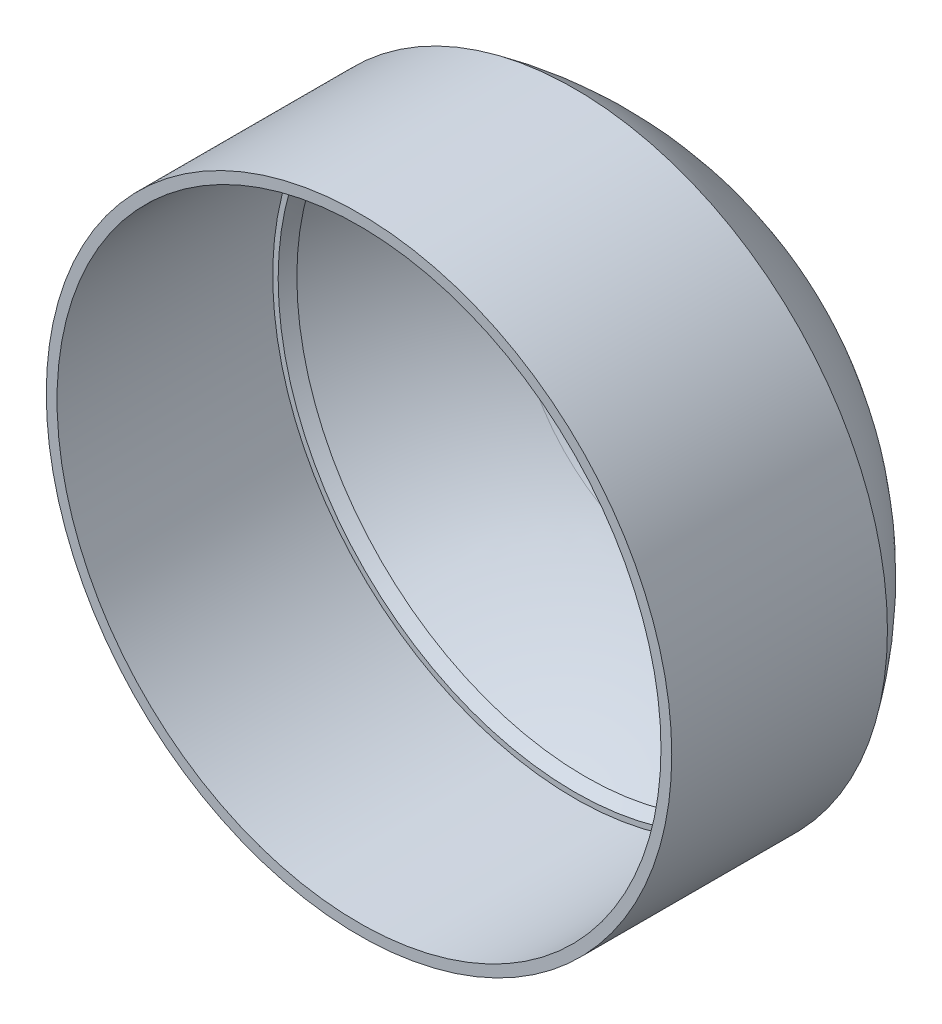
ISO-10303-21;
HEADER;
FILE_DESCRIPTION(('STEP AP214'),'2;1');
FILE_NAME('part.step','',(''),(''),'','','');
FILE_SCHEMA(('AUTOMOTIVE_DESIGN { 1 0 10303 214 1 1 1 1 }'));
ENDSEC;
DATA;
#1=APPLICATION_CONTEXT('core data for automotive mechanical design processes');
#2=APPLICATION_PROTOCOL_DEFINITION('international standard','automotive_design',2000,#1);
#3=PRODUCT_CONTEXT('',#1,'mechanical');
#4=PRODUCT('Part','Part','',(#3));
#5=PRODUCT_RELATED_PRODUCT_CATEGORY('part','',(#4));
#6=PRODUCT_DEFINITION_FORMATION('','',#4);
#7=PRODUCT_DEFINITION_CONTEXT('part definition',#1,'design');
#8=PRODUCT_DEFINITION('design','',#6,#7);
#9=PRODUCT_DEFINITION_SHAPE('','',#8);
#10=(LENGTH_UNIT() NAMED_UNIT(*) SI_UNIT(.MILLI.,.METRE.));
#11=(NAMED_UNIT(*) PLANE_ANGLE_UNIT() SI_UNIT($,.RADIAN.));
#12=(NAMED_UNIT(*) SI_UNIT($,.STERADIAN.) SOLID_ANGLE_UNIT());
#13=UNCERTAINTY_MEASURE_WITH_UNIT(LENGTH_MEASURE(1.E-05),#10,'distance_accuracy_value','');
#14=(GEOMETRIC_REPRESENTATION_CONTEXT(3) GLOBAL_UNCERTAINTY_ASSIGNED_CONTEXT((#13)) GLOBAL_UNIT_ASSIGNED_CONTEXT((#10,
#11,#12)) REPRESENTATION_CONTEXT('',''));
#15=CARTESIAN_POINT('',(0.,0.,0.));
#16=DIRECTION('',(0.,0.,1.));
#17=DIRECTION('',(1.,0.,0.));
#18=AXIS2_PLACEMENT_3D('',#15,#16,#17);
#19=CARTESIAN_POINT('',(0.,0.,10.));
#20=DIRECTION('',(0.,0.,1.));
#21=DIRECTION('',(1.,0.,0.));
#22=AXIS2_PLACEMENT_3D('',#19,#20,#21);
#23=PLANE('',#22);
#24=CARTESIAN_POINT('',(0.,0.,10.));
#25=DIRECTION('',(0.,0.,1.));
#26=DIRECTION('',(1.,0.,0.));
#27=AXIS2_PLACEMENT_3D('',#24,#25,#26);
#28=CIRCLE('',#27,29.);
#29=CARTESIAN_POINT('',(29.,0.,10.));
#30=VERTEX_POINT('',#29);
#31=EDGE_CURVE('E11',#30,#30,#28,.T.);
#32=ORIENTED_EDGE('',*,*,#31,.T.);
#33=EDGE_LOOP('',(#32));
#34=FACE_BOUND('',#33,.T.);
#35=CARTESIAN_POINT('',(0.,0.,10.));
#36=DIRECTION('',(0.,0.,1.));
#37=DIRECTION('',(1.,0.,0.));
#38=AXIS2_PLACEMENT_3D('',#35,#36,#37);
#39=CIRCLE('',#38,28.);
#40=CARTESIAN_POINT('',(28.,0.,10.));
#41=VERTEX_POINT('',#40);
#42=EDGE_CURVE('E55',#41,#41,#39,.T.);
#43=ORIENTED_EDGE('',*,*,#42,.F.);
#44=EDGE_LOOP('',(#43));
#45=FACE_BOUND('',#44,.T.);
#46=ADVANCED_FACE('F47',(#34,#45),#23,.T.);
#47=CARTESIAN_POINT('',(0.,0.,10.));
#48=DIRECTION('',(0.,0.,-1.));
#49=DIRECTION('',(-1.,0.,0.));
#50=AXIS2_PLACEMENT_3D('',#47,#48,#49);
#51=CYLINDRICAL_SURFACE('',#50,29.);
#52=ORIENTED_EDGE('',*,*,#31,.F.);
#53=EDGE_LOOP('',(#52));
#54=FACE_BOUND('',#53,.T.);
#55=CARTESIAN_POINT('',(0.,0.,-10.));
#56=DIRECTION('',(0.,0.,1.));
#57=DIRECTION('',(1.,0.,0.));
#58=AXIS2_PLACEMENT_3D('',#55,#56,#57);
#59=CIRCLE('',#58,29.);
#60=CARTESIAN_POINT('',(29.,0.,-10.));
#61=VERTEX_POINT('',#60);
#62=EDGE_CURVE('E82',#61,#61,#59,.T.);
#63=ORIENTED_EDGE('',*,*,#62,.T.);
#64=EDGE_LOOP('',(#63));
#65=FACE_BOUND('',#64,.T.);
#66=ADVANCED_FACE('F49',(#54,#65),#51,.T.);
#67=CARTESIAN_POINT('',(0.,0.,10.));
#68=DIRECTION('',(0.,0.,-1.));
#69=DIRECTION('',(-1.,0.,0.));
#70=AXIS2_PLACEMENT_3D('',#67,#68,#69);
#71=CYLINDRICAL_SURFACE('',#70,28.);
#72=ORIENTED_EDGE('',*,*,#42,.T.);
#73=EDGE_LOOP('',(#72));
#74=FACE_BOUND('',#73,.T.);
#75=CARTESIAN_POINT('',(0.,0.,-10.));
#76=DIRECTION('',(0.,0.,1.));
#77=DIRECTION('',(1.,0.,0.));
#78=AXIS2_PLACEMENT_3D('',#75,#76,#77);
#79=CIRCLE('',#78,28.);
#80=CARTESIAN_POINT('',(28.,0.,-10.));
#81=VERTEX_POINT('',#80);
#82=EDGE_CURVE('E60',#81,#81,#79,.T.);
#83=ORIENTED_EDGE('',*,*,#82,.F.);
#84=EDGE_LOOP('',(#83));
#85=FACE_BOUND('',#84,.T.);
#86=ADVANCED_FACE('F91',(#74,#85),#71,.F.);
#87=CARTESIAN_POINT('',(0.,29.,-10.));
#88=DIRECTION('',(0.,0.,-1.));
#89=DIRECTION('',(-1.,0.,0.));
#90=AXIS2_PLACEMENT_3D('',#87,#88,#89);
#91=PLANE('',#90);
#92=CARTESIAN_POINT('',(0.,0.,-10.));
#93=DIRECTION('',(0.,0.,1.));
#94=DIRECTION('',(1.,0.,0.));
#95=AXIS2_PLACEMENT_3D('',#92,#93,#94);
#96=CIRCLE('',#95,27.4967854174264);
#97=CARTESIAN_POINT('',(27.4967854174264,0.,-10.));
#98=VERTEX_POINT('',#97);
#99=EDGE_CURVE('E66',#98,#98,#96,.T.);
#100=ORIENTED_EDGE('',*,*,#99,.F.);
#101=EDGE_LOOP('',(#100));
#102=FACE_BOUND('',#101,.T.);
#103=ORIENTED_EDGE('',*,*,#82,.T.);
#104=EDGE_LOOP('',(#103));
#105=FACE_BOUND('',#104,.T.);
#106=ADVANCED_FACE('F89',(#102,#105),#91,.F.);
#107=CARTESIAN_POINT('',(0.,0.,9.9989083869987));
#108=DIRECTION('',(0.,0.,1.));
#109=DIRECTION('',(1.,0.,0.));
#110=AXIS2_PLACEMENT_3D('',#107,#108,#109);
#111=DEGENERATE_TOROIDAL_SURFACE('',#110,0.276426696379981,35.,.T.);
#112=CARTESIAN_POINT('',(0.,0.,-24.9796974795974));
#113=DIRECTION('',(0.,0.,1.));
#114=DIRECTION('',(1.,0.,0.));
#115=AXIS2_PLACEMENT_3D('',#112,#113,#114);
#116=CIRCLE('',#115,1.5);
#117=CARTESIAN_POINT('',(1.5,0.,-24.9796974795974));
#118=VERTEX_POINT('',#117);
#119=EDGE_CURVE('E73',#118,#118,#116,.T.);
#120=ORIENTED_EDGE('',*,*,#119,.T.);
#121=EDGE_LOOP('',(#120));
#122=FACE_BOUND('',#121,.T.);
#123=ORIENTED_EDGE('',*,*,#62,.F.);
#124=EDGE_LOOP('',(#123));
#125=FACE_BOUND('',#124,.T.);
#126=ADVANCED_FACE('F99',(#122,#125),#111,.T.);
#127=CARTESIAN_POINT('',(0.,0.,8.99601999462661));
#128=DIRECTION('',(0.,0.,1.));
#129=DIRECTION('',(1.,0.,0.));
#130=AXIS2_PLACEMENT_3D('',#127,#128,#129);
#131=DEGENERATE_TOROIDAL_SURFACE('',#130,0.512508062571321,33.,.T.);
#132=CARTESIAN_POINT('',(0.,0.,-11.));
#133=DIRECTION('',(0.,0.,-1.));
#134=DIRECTION('',(-1.,0.,0.));
#135=AXIS2_PLACEMENT_3D('',#132,#133,#134);
#136=CIRCLE('',#135,26.7643496051087);
#137=CARTESIAN_POINT('',(-26.7643496051087,0.,-11.));
#138=VERTEX_POINT('',#137);
#139=EDGE_CURVE('E63',#138,#138,#136,.F.);
#140=ORIENTED_EDGE('',*,*,#139,.F.);
#141=EDGE_LOOP('',(#140));
#142=FACE_BOUND('',#141,.T.);
#143=ORIENTED_EDGE('',*,*,#99,.T.);
#144=EDGE_LOOP('',(#143));
#145=FACE_BOUND('',#144,.T.);
#146=ADVANCED_FACE('F133',(#142,#145),#131,.F.);
#147=CARTESIAN_POINT('',(0.,0.,9.9989083869987));
#148=DIRECTION('',(0.,0.,1.));
#149=DIRECTION('',(1.,0.,0.));
#150=AXIS2_PLACEMENT_3D('',#147,#148,#149);
#151=DEGENERATE_TOROIDAL_SURFACE('',#150,0.276426696379981,34.,.T.);
#152=CARTESIAN_POINT('',(0.,0.,-11.));
#153=DIRECTION('',(0.,0.,1.));
#154=DIRECTION('',(1.,0.,0.));
#155=AXIS2_PLACEMENT_3D('',#152,#153,#154);
#156=CIRCLE('',#155,27.0167678788413);
#157=CARTESIAN_POINT('',(27.0167678788413,0.,-11.));
#158=VERTEX_POINT('',#157);
#159=EDGE_CURVE('E70',#158,#158,#156,.T.);
#160=ORIENTED_EDGE('',*,*,#159,.T.);
#161=EDGE_LOOP('',(#160));
#162=FACE_BOUND('',#161,.T.);
#163=CARTESIAN_POINT('',(0.,0.,-20.304513241829));
#164=DIRECTION('',(0.,0.,-1.));
#165=DIRECTION('',(-1.,0.,0.));
#166=AXIS2_PLACEMENT_3D('',#163,#164,#165);
#167=CIRCLE('',#166,15.6940347334751);
#168=CARTESIAN_POINT('',(-15.6940347334751,0.,-20.304513241829));
#169=VERTEX_POINT('',#168);
#170=EDGE_CURVE('E65',#169,#169,#167,.T.);
#171=ORIENTED_EDGE('',*,*,#170,.T.);
#172=EDGE_LOOP('',(#171));
#173=FACE_BOUND('',#172,.T.);
#174=ADVANCED_FACE('F138',(#162,#173),#151,.F.);
#175=CARTESIAN_POINT('',(0.,0.276426696379981,-11.));
#176=DIRECTION('',(0.,0.,-1.));
#177=DIRECTION('',(-1.,0.,0.));
#178=AXIS2_PLACEMENT_3D('',#175,#176,#177);
#179=PLANE('',#178);
#180=ORIENTED_EDGE('',*,*,#139,.T.);
#181=EDGE_LOOP('',(#180));
#182=FACE_BOUND('',#181,.T.);
#183=ORIENTED_EDGE('',*,*,#159,.F.);
#184=EDGE_LOOP('',(#183));
#185=FACE_BOUND('',#184,.T.);
#186=ADVANCED_FACE('F152',(#182,#185),#179,.T.);
#187=CARTESIAN_POINT('',(0.,0.,-23.9892018429405));
#188=DIRECTION('',(0.,0.,1.));
#189=DIRECTION('',(1.,0.,0.));
#190=AXIS2_PLACEMENT_3D('',#187,#188,#189);
#191=CIRCLE('',#190,1.5);
#192=CARTESIAN_POINT('',(1.5,0.,-23.9892018429405));
#193=VERTEX_POINT('',#192);
#194=EDGE_CURVE('E51',#193,#193,#191,.T.);
#195=ORIENTED_EDGE('',*,*,#194,.F.);
#196=EDGE_LOOP('',(#195));
#197=FACE_BOUND('',#196,.T.);
#198=ORIENTED_EDGE('',*,*,#170,.F.);
#199=EDGE_LOOP('',(#198));
#200=FACE_BOUND('',#199,.T.);
#201=ADVANCED_FACE('F141',(#197,#200),#131,.F.);
#202=CARTESIAN_POINT('',(0.,0.,-25.0010916130013));
#203=DIRECTION('',(0.,0.,1.));
#204=DIRECTION('',(1.,0.,0.));
#205=AXIS2_PLACEMENT_3D('',#202,#203,#204);
#206=CYLINDRICAL_SURFACE('',#205,1.5);
#207=ORIENTED_EDGE('',*,*,#194,.T.);
#208=EDGE_LOOP('',(#207));
#209=FACE_BOUND('',#208,.T.);
#210=ORIENTED_EDGE('',*,*,#119,.F.);
#211=EDGE_LOOP('',(#210));
#212=FACE_BOUND('',#211,.T.);
#213=ADVANCED_FACE('F176',(#209,#212),#206,.F.);
#214=CLOSED_SHELL('',(#46,#66,#86,#106,#126,#146,#174,#186,#201,#213));
#215=MANIFOLD_SOLID_BREP('B2',#214);
#216=ADVANCED_BREP_SHAPE_REPRESENTATION('',(#18,#215),#14);
#217=SHAPE_DEFINITION_REPRESENTATION(#9,#216);
ENDSEC;
END-ISO-10303-21;
